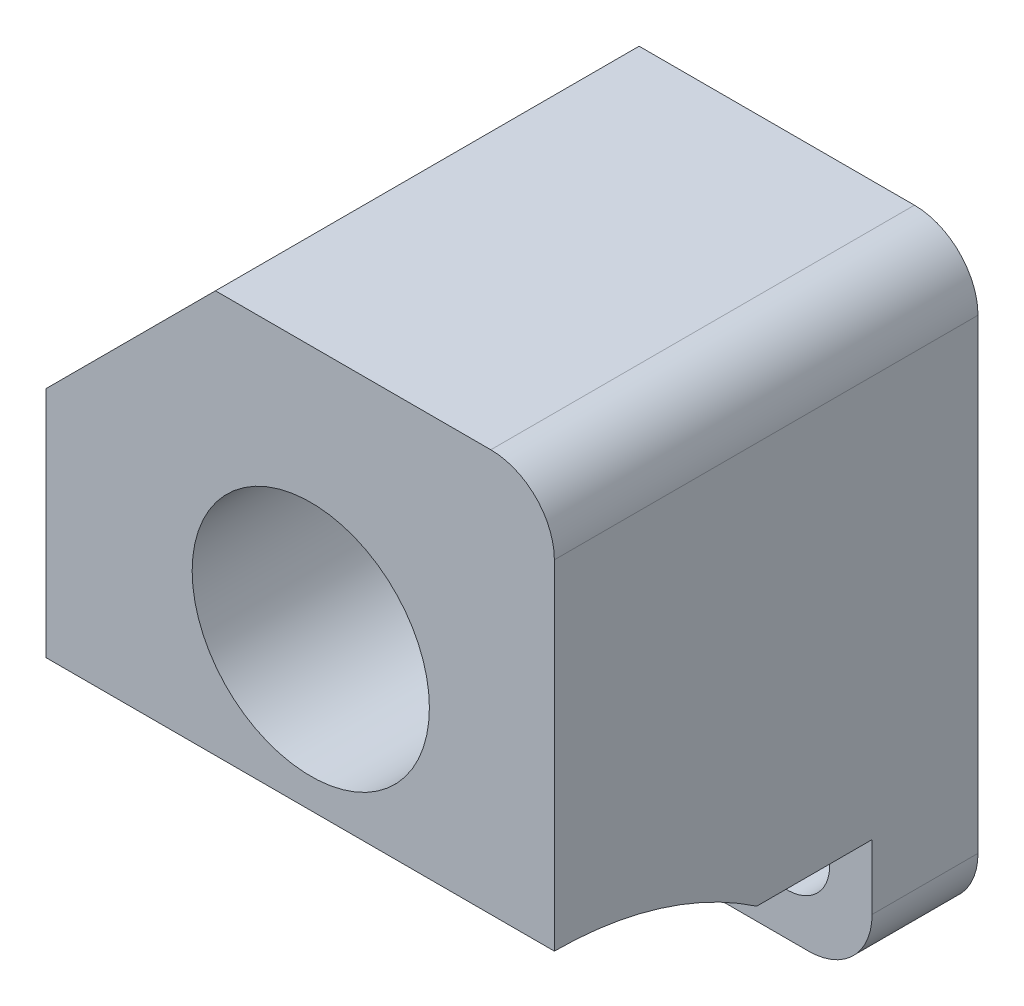
ISO-10303-21;
HEADER;
FILE_DESCRIPTION(('STEP AP214'),'2;1');
FILE_NAME('part.step','',(''),(''),'','','');
FILE_SCHEMA(('AUTOMOTIVE_DESIGN { 1 0 10303 214 1 1 1 1 }'));
ENDSEC;
DATA;
#1=APPLICATION_CONTEXT('core data for automotive mechanical design processes');
#2=APPLICATION_PROTOCOL_DEFINITION('international standard','automotive_design',2000,#1);
#3=PRODUCT_CONTEXT('',#1,'mechanical');
#4=PRODUCT('Part','Part','',(#3));
#5=PRODUCT_RELATED_PRODUCT_CATEGORY('part','',(#4));
#6=PRODUCT_DEFINITION_FORMATION('','',#4);
#7=PRODUCT_DEFINITION_CONTEXT('part definition',#1,'design');
#8=PRODUCT_DEFINITION('design','',#6,#7);
#9=PRODUCT_DEFINITION_SHAPE('','',#8);
#10=(LENGTH_UNIT() NAMED_UNIT(*) SI_UNIT(.MILLI.,.METRE.));
#11=(NAMED_UNIT(*) PLANE_ANGLE_UNIT() SI_UNIT($,.RADIAN.));
#12=(NAMED_UNIT(*) SI_UNIT($,.STERADIAN.) SOLID_ANGLE_UNIT());
#13=UNCERTAINTY_MEASURE_WITH_UNIT(LENGTH_MEASURE(1.E-05),#10,'distance_accuracy_value','');
#14=(GEOMETRIC_REPRESENTATION_CONTEXT(3) GLOBAL_UNCERTAINTY_ASSIGNED_CONTEXT((#13)) GLOBAL_UNIT_ASSIGNED_CONTEXT((#10,
#11,#12)) REPRESENTATION_CONTEXT('',''));
#15=CARTESIAN_POINT('',(0.,0.,0.));
#16=DIRECTION('',(0.,0.,1.));
#17=DIRECTION('',(1.,0.,0.));
#18=AXIS2_PLACEMENT_3D('',#15,#16,#17);
#19=CARTESIAN_POINT('',(-14.,4.,20.));
#20=DIRECTION('',(0.,0.,-1.));
#21=DIRECTION('',(1.,0.,0.));
#22=AXIS2_PLACEMENT_3D('',#19,#20,#21);
#23=CYLINDRICAL_SURFACE('',#22,2.00000000000001);
#24=CARTESIAN_POINT('',(-14.,4.,0.));
#25=DIRECTION('',(0.,0.,-1.));
#26=DIRECTION('',(-1.,0.,0.));
#27=AXIS2_PLACEMENT_3D('',#24,#25,#26);
#28=CIRCLE('',#27,2.00000000000001);
#29=CARTESIAN_POINT('',(-16.,4.,0.));
#30=VERTEX_POINT('',#29);
#31=EDGE_CURVE('E232',#30,#30,#28,.T.);
#32=ORIENTED_EDGE('',*,*,#31,.T.);
#33=EDGE_LOOP('',(#32));
#34=FACE_BOUND('',#33,.T.);
#35=CARTESIAN_POINT('',(-14.,4.,5.));
#36=DIRECTION('',(0.,0.,-1.));
#37=DIRECTION('',(-1.,0.,0.));
#38=AXIS2_PLACEMENT_3D('',#35,#36,#37);
#39=CIRCLE('',#38,2.00000000000001);
#40=CARTESIAN_POINT('',(-16.,4.,5.));
#41=VERTEX_POINT('',#40);
#42=EDGE_CURVE('E175',#41,#41,#39,.T.);
#43=ORIENTED_EDGE('',*,*,#42,.F.);
#44=EDGE_LOOP('',(#43));
#45=FACE_BOUND('',#44,.T.);
#46=ADVANCED_FACE('F52',(#34,#45),#23,.F.);
#47=CARTESIAN_POINT('',(-4.,4.,20.));
#48=DIRECTION('',(0.,0.,-1.));
#49=DIRECTION('',(1.,0.,0.));
#50=AXIS2_PLACEMENT_3D('',#47,#48,#49);
#51=CYLINDRICAL_SURFACE('',#50,2.);
#52=CARTESIAN_POINT('',(-4.,4.,0.));
#53=DIRECTION('',(0.,0.,-1.));
#54=DIRECTION('',(-1.,0.,0.));
#55=AXIS2_PLACEMENT_3D('',#52,#53,#54);
#56=CIRCLE('',#55,2.);
#57=CARTESIAN_POINT('',(-6.,4.,0.));
#58=VERTEX_POINT('',#57);
#59=EDGE_CURVE('E229',#58,#58,#56,.T.);
#60=ORIENTED_EDGE('',*,*,#59,.T.);
#61=EDGE_LOOP('',(#60));
#62=FACE_BOUND('',#61,.T.);
#63=CARTESIAN_POINT('',(-4.,4.,5.));
#64=DIRECTION('',(0.,0.,-1.));
#65=DIRECTION('',(-1.,0.,0.));
#66=AXIS2_PLACEMENT_3D('',#63,#64,#65);
#67=CIRCLE('',#66,2.);
#68=CARTESIAN_POINT('',(-6.,4.,5.));
#69=VERTEX_POINT('',#68);
#70=EDGE_CURVE('E195',#69,#69,#67,.T.);
#71=ORIENTED_EDGE('',*,*,#70,.F.);
#72=EDGE_LOOP('',(#71));
#73=FACE_BOUND('',#72,.T.);
#74=ADVANCED_FACE('F279',(#62,#73),#51,.F.);
#75=CARTESIAN_POINT('',(-30.,-8.,20.));
#76=DIRECTION('',(1.,0.,0.));
#77=DIRECTION('',(0.,0.,1.));
#78=AXIS2_PLACEMENT_3D('',#75,#76,#77);
#79=CYLINDRICAL_SURFACE('',#78,17.);
#80=DIRECTION('',(1.,0.,0.));
#81=VECTOR('',#80,1.);
#82=CARTESIAN_POINT('',(-30.,0.,5.));
#83=LINE('',#82,#81);
#84=CARTESIAN_POINT('',(-21.,0.,5.));
#85=VERTEX_POINT('',#84);
#86=CARTESIAN_POINT('',(-18.5,0.,5.));
#87=VERTEX_POINT('',#86);
#88=EDGE_CURVE('E204',#85,#87,#83,.T.);
#89=ORIENTED_EDGE('',*,*,#88,.T.);
#90=CARTESIAN_POINT('',(-18.5,-8.,20.));
#91=DIRECTION('',(-1.,0.,0.));
#92=DIRECTION('',(0.,0.,1.));
#93=AXIS2_PLACEMENT_3D('',#90,#91,#92);
#94=CIRCLE('',#93,17.);
#95=CARTESIAN_POINT('',(-18.5,4.,7.95840542120771));
#96=VERTEX_POINT('',#95);
#97=EDGE_CURVE('E267',#87,#96,#94,.F.);
#98=ORIENTED_EDGE('',*,*,#97,.T.);
#99=CARTESIAN_POINT('',(-9.5,4.,7.95840542120771));
#100=CARTESIAN_POINT('',(-9.50000395748743,4.0914044943781,8.04949132167229));
#101=CARTESIAN_POINT('',(-9.50278443637128,4.18174793081795,8.14160020463122));
#102=CARTESIAN_POINT('',(-9.51354425939322,4.36014679583887,8.32766663141079));
#103=CARTESIAN_POINT('',(-9.52152221693664,4.44820282814512,8.42162367569323));
#104=CARTESIAN_POINT('',(-9.55268635889075,4.70845168618201,8.70570470111247));
#105=CARTESIAN_POINT('',(-9.58310539350724,4.87705426348768,8.89836667047146));
#106=CARTESIAN_POINT('',(-9.66071062561587,5.20362882044656,9.28883961018568));
#107=CARTESIAN_POINT('',(-9.70788229851281,5.36160986833163,9.48664598307452));
#108=CARTESIAN_POINT('',(-9.81694196826845,5.66682146216995,9.88657773351949));
#109=CARTESIAN_POINT('',(-9.87883788591081,5.81404616592655,10.0887053822212));
#110=CARTESIAN_POINT('',(-10.0422768703318,6.15274010826598,10.5756229392214));
#111=CARTESIAN_POINT('',(-10.1498718371989,6.33910365027113,10.8619413022325));
#112=CARTESIAN_POINT('',(-10.3868255480558,6.69071882436846,11.4386404274752));
#113=CARTESIAN_POINT('',(-10.5161944052909,6.85596058305805,11.7290230196787));
#114=CARTESIAN_POINT('',(-10.725125031537,7.08804017742802,12.1655752813407));
#115=CARTESIAN_POINT('',(-10.7972255833663,7.16275058924888,12.3112143369148));
#116=CARTESIAN_POINT('',(-10.94637421519,7.3069832939709,12.6025231342558));
#117=CARTESIAN_POINT('',(-11.0234218620924,7.37650603987564,12.7481928722268));
#118=CARTESIAN_POINT('',(-11.1825032854109,7.5103435015509,13.039047880639));
#119=CARTESIAN_POINT('',(-11.264533570196,7.57466179233645,13.1842334168163));
#120=CARTESIAN_POINT('',(-11.433928743452,7.69814359271443,13.4736661730226));
#121=CARTESIAN_POINT('',(-11.5212930727269,7.7573076410805,13.6179134896618));
#122=CARTESIAN_POINT('',(-11.7146448878973,7.87839404118929,13.9248458401706));
#123=CARTESIAN_POINT('',(-11.8215253265758,7.93953834902523,14.0872776026382));
#124=CARTESIAN_POINT('',(-12.0448316631065,8.05502203209583,14.408457717902));
#125=CARTESIAN_POINT('',(-12.1612717073346,8.10935101032875,14.5672001490545));
#126=CARTESIAN_POINT('',(-12.345885514194,8.18549337429666,14.800326803985));
#127=CARTESIAN_POINT('',(-12.4093714767174,8.21007449329534,14.8775193491295));
#128=CARTESIAN_POINT('',(-12.5402232570303,8.2572171469658,15.0291673409341));
#129=CARTESIAN_POINT('',(-12.6075876949894,8.27977939267672,15.1036237457641));
#130=CARTESIAN_POINT('',(-12.7469223379722,8.32262625082576,15.2484155210567));
#131=CARTESIAN_POINT('',(-12.8188792369324,8.34291701268087,15.3187617587281));
#132=CARTESIAN_POINT('',(-12.9687167322031,8.38091634160638,15.4535228865071));
#133=CARTESIAN_POINT('',(-13.0465885507,8.39862862548794,15.5179462638691));
#134=CARTESIAN_POINT('',(-13.1941016051383,8.42775727176136,15.6260655479983));
#135=CARTESIAN_POINT('',(-13.2624395430502,8.43972919881483,15.6713638199573));
#136=CARTESIAN_POINT('',(-13.4046729696058,8.46102419614452,15.7530647084529));
#137=CARTESIAN_POINT('',(-13.4785596671599,8.47035134913693,15.7894810237043));
#138=CARTESIAN_POINT('',(-13.6166773372808,8.48406878122557,15.8435466627931));
#139=CARTESIAN_POINT('',(-13.6799311524168,8.48907041147643,15.863482478682));
#140=CARTESIAN_POINT('',(-13.8089781146089,8.49640599885808,15.8928322984602));
#141=CARTESIAN_POINT('',(-13.8747671995161,8.49874405386169,15.9022624646475));
#142=CARTESIAN_POINT('',(-14.0073549707445,8.50048396050065,15.9092730577385));
#143=CARTESIAN_POINT('',(-14.0741569643444,8.49987184283835,15.906797108382));
#144=CARTESIAN_POINT('',(-14.2062203958256,8.49575979538804,15.890258738635));
#145=CARTESIAN_POINT('',(-14.2714801066021,8.49225677252071,15.8761839082241));
#146=CARTESIAN_POINT('',(-14.4177913135748,8.48133054083102,15.8327023930196));
#147=CARTESIAN_POINT('',(-14.497769253972,8.47305145750561,15.7999814858164));
#148=CARTESIAN_POINT('',(-14.6515795378446,8.45325783552328,15.7230994785655));
#149=CARTESIAN_POINT('',(-14.7253934228522,8.44173400121762,15.6789055390671));
#150=CARTESIAN_POINT('',(-14.8821498999958,8.41354873566514,15.5729232290321));
#151=CARTESIAN_POINT('',(-14.9637829499255,8.39631702119702,15.5093877860398));
#152=CARTESIAN_POINT('',(-15.1204837149191,8.35901463834684,15.3753366849474));
#153=CARTESIAN_POINT('',(-15.1955388928886,8.33893873169459,15.3048082210926));
#154=CARTESIAN_POINT('',(-15.3407744029065,8.29628650985611,15.158836412858));
#155=CARTESIAN_POINT('',(-15.4109248104231,8.27369671391476,15.083367561136));
#156=CARTESIAN_POINT('',(-15.5468840112846,8.22638369848768,14.9294019320264));
#157=CARTESIAN_POINT('',(-15.6126961030444,8.20166213357681,14.8509075286325));
#158=CARTESIAN_POINT('',(-15.7716092214206,8.13785763107547,14.6535190431871));
#159=CARTESIAN_POINT('',(-15.8626265891695,8.09758210946055,14.5333369700502));
#160=CARTESIAN_POINT('',(-16.0386639222831,8.01290075716924,14.2900405482304));
#161=CARTESIAN_POINT('',(-16.1236814332532,7.96849325322531,14.166925026778));
#162=CARTESIAN_POINT('',(-16.2888027146167,7.87561177279548,13.9186729687858));
#163=CARTESIAN_POINT('',(-16.3688992404388,7.8271320384045,13.7935337797022));
#164=CARTESIAN_POINT('',(-16.5246639843038,7.72621417175508,13.5420932413085));
#165=CARTESIAN_POINT('',(-16.6003316167907,7.67377551816627,13.4157917408692));
#166=CARTESIAN_POINT('',(-16.8214258279169,7.51044543156766,13.0356530003998));
#167=CARTESIAN_POINT('',(-16.960800768262,7.39362125441372,12.7808007169415));
#168=CARTESIAN_POINT('',(-17.2243785507563,7.14423442726891,12.2713107945576));
#169=CARTESIAN_POINT('',(-17.3485935073991,7.01168451315524,12.0166731478797));
#170=CARTESIAN_POINT('',(-17.5876510079521,6.72317416813715,11.4958040227481));
#171=CARTESIAN_POINT('',(-17.7016599519492,6.56635037299425,11.2296651599127));
#172=CARTESIAN_POINT('',(-17.9108486053268,6.2346613390059,10.7009761246614));
#173=CARTESIAN_POINT('',(-18.0060184144837,6.05978668723912,10.4384279062847));
#174=CARTESIAN_POINT('',(-18.1741829876603,5.69311968600992,9.9203860058721));
#175=CARTESIAN_POINT('',(-18.2472997352338,5.50142826457879,9.66486089874401));
#176=CARTESIAN_POINT('',(-18.3682677475141,5.10087784416679,9.16163419247375));
#177=CARTESIAN_POINT('',(-18.4161475882968,4.89203857308064,8.91392404457169));
#178=CARTESIAN_POINT('',(-18.4655378014299,4.56660518108971,8.54980075912049));
#179=CARTESIAN_POINT('',(-18.4782647178343,4.45595648186604,8.42952511075732));
#180=CARTESIAN_POINT('',(-18.4954961993189,4.23078580948268,8.19175047629548));
#181=CARTESIAN_POINT('',(-18.49998969487,4.11625883237395,8.07425543767465));
#182=CARTESIAN_POINT('',(-18.5,4.00000000000001,7.95840542120771));
#183=B_SPLINE_CURVE_WITH_KNOTS('',3,(#99,#100,#101,#102,#103,#104,#105,#106,#107,#108,#109,#110,
#111,#112,#113,#114,#115,#116,#117,#118,#119,#120,#121,#122,#123,#124,#125,#126,#127,#128,#129,
#130,#131,#132,#133,#134,#135,#136,#137,#138,#139,#140,#141,#142,#143,#144,#145,#146,#147,#148,
#149,#150,#151,#152,#153,#154,#155,#156,#157,#158,#159,#160,#161,#162,#163,#164,#165,#166,#167,
#168,#169,#170,#171,#172,#173,#174,#175,#176,#177,#178,#179,#180,#181,#182),.UNSPECIFIED.,.F.,
.F.,(4,2,2,2,2,2,2,2,2,2,2,2,2,2,2,2,2,2,2,2,2,2,2,2,2,2,2,2,2,2,2,2,2,2,2,2,2,2,2,2,2,4),(0.,
0.387032748470064,0.773962285759765,1.54643256241779,2.31823473316158,3.09045303102278,
4.16348813096331,5.23702300224475,5.77348634923154,6.30990279556861,6.84594758523306,
7.38193627466361,7.99314134345302,8.60526776995012,8.91394559425845,9.22251427200547,
9.53022628057543,9.83749024208736,10.0855769742731,10.3332786257619,10.5320323216932,
10.7304798231721,10.929867909676,11.1294696053839,11.3884157008732,11.6481113147416,
11.9620016742115,12.2764778415883,12.5927300136787,12.9087388983729,13.3766012997366,
13.8446539958794,14.3133800067392,14.7821678498207,15.7205636951521,16.658204679695,
17.6450375397983,18.6323876253434,19.6141716947542,20.5948416761479,21.0863721296846,
21.5785629441533),.UNSPECIFIED.);
#184=CARTESIAN_POINT('',(-9.5,4.,7.95840542120771));
#185=VERTEX_POINT('',#184);
#186=EDGE_CURVE('E258',#185,#96,#183,.T.);
#187=ORIENTED_EDGE('',*,*,#186,.F.);
#188=CARTESIAN_POINT('',(-9.50000000000001,-8.,20.));
#189=DIRECTION('',(-1.,0.,0.));
#190=DIRECTION('',(0.,-1.,0.));
#191=AXIS2_PLACEMENT_3D('',#188,#189,#190);
#192=CIRCLE('',#191,17.);
#193=CARTESIAN_POINT('',(-9.5,0.,5.));
#194=VERTEX_POINT('',#193);
#195=EDGE_CURVE('E255',#194,#185,#192,.F.);
#196=ORIENTED_EDGE('',*,*,#195,.F.);
#197=CARTESIAN_POINT('',(-8.49999999999999,0.,5.));
#198=VERTEX_POINT('',#197);
#199=EDGE_CURVE('E389',#194,#198,#83,.T.);
#200=ORIENTED_EDGE('',*,*,#199,.T.);
#201=CARTESIAN_POINT('',(-8.49999999999999,-8.,20.));
#202=DIRECTION('',(-1.,0.,0.));
#203=DIRECTION('',(0.,0.,1.));
#204=AXIS2_PLACEMENT_3D('',#201,#202,#203);
#205=CIRCLE('',#204,17.);
#206=CARTESIAN_POINT('',(-8.49999999999999,4.,7.95840542120771));
#207=VERTEX_POINT('',#206);
#208=EDGE_CURVE('E178',#198,#207,#205,.F.);
#209=ORIENTED_EDGE('',*,*,#208,.T.);
#210=CARTESIAN_POINT('',(0.,6.06155281280885,10.4463236137816));
#211=CARTESIAN_POINT('',(-0.0495576649739206,6.15768125691109,10.5878060626458));
#212=CARTESIAN_POINT('',(-0.102114391334273,6.25117350422128,10.7300098451449));
#213=CARTESIAN_POINT('',(-0.212865824775228,6.43289213636139,11.0155556706595));
#214=CARTESIAN_POINT('',(-0.271059795672405,6.52111920636005,11.1588975628075));
#215=CARTESIAN_POINT('',(-0.392808866787494,6.69243783253494,11.4466181049227));
#216=CARTESIAN_POINT('',(-0.45637007379429,6.77552334734409,11.5909977600859));
#217=CARTESIAN_POINT('',(-0.588562309680955,6.93648457041131,11.8803427208734));
#218=CARTESIAN_POINT('',(-0.657193475464848,7.01436013787696,12.0253080422125));
#219=CARTESIAN_POINT('',(-0.798884011374749,7.16440014843562,12.3144739217149));
#220=CARTESIAN_POINT('',(-0.871908451567413,7.23660124035958,12.4586725948106));
#221=CARTESIAN_POINT('',(-1.02281525786022,7.37593242064748,12.7469777116518));
#222=CARTESIAN_POINT('',(-1.10069759281922,7.44306254151237,12.8910841559824));
#223=CARTESIAN_POINT('',(-1.26141572676633,7.57222318194456,13.1786591519161));
#224=CARTESIAN_POINT('',(-1.34424781751823,7.6342574384805,13.3221280966491));
#225=CARTESIAN_POINT('',(-1.5152789966516,7.7532682254799,13.6079356867605));
#226=CARTESIAN_POINT('',(-1.60347707727965,7.81024570071446,13.7502745387328));
#227=CARTESIAN_POINT('',(-1.74501163673931,7.89466979089833,13.9695401930718));
#228=CARTESIAN_POINT('',(-1.79622918526569,7.92389345240162,14.0471540620925));
#229=CARTESIAN_POINT('',(-1.90070785779715,7.98076651506496,14.2015620776224));
#230=CARTESIAN_POINT('',(-1.95396882616314,8.00841603572414,14.2783562859946));
#231=CARTESIAN_POINT('',(-2.11754724864029,8.08916521438071,14.5077323909514));
#232=CARTESIAN_POINT('',(-2.23131987915113,8.13986032677673,14.6587727944357));
#233=CARTESIAN_POINT('',(-2.41172254496275,8.21088686373001,14.8801113434367));
#234=CARTESIAN_POINT('',(-2.47376765201981,8.23381360743637,14.9533226614076));
#235=CARTESIAN_POINT('',(-2.60166171762401,8.27776007998216,15.0969247590182));
#236=CARTESIAN_POINT('',(-2.66750920702344,8.29878053740091,15.1673166104608));
#237=CARTESIAN_POINT('',(-2.80364504189143,8.33863453962015,15.3038252643999));
#238=CARTESIAN_POINT('',(-2.87391594679102,8.35747593270061,15.3699570030888));
#239=CARTESIAN_POINT('',(-3.02019428658114,8.39267996794466,15.4961890159489));
#240=CARTESIAN_POINT('',(-3.09619277785561,8.40904635939768,15.5562983656353));
#241=CARTESIAN_POINT('',(-3.23997433299755,8.43583388612464,15.6565541951015));
#242=CARTESIAN_POINT('',(-3.30651305772318,8.44679284085669,15.698314641397));
#243=CARTESIAN_POINT('',(-3.44475719099679,8.46615695450915,15.7730432755605));
#244=CARTESIAN_POINT('',(-3.51645534062082,8.47456561782761,15.8060235207584));
#245=CARTESIAN_POINT('',(-3.65181174771634,8.48692936737446,15.8549197405297));
#246=CARTESIAN_POINT('',(-3.71469219259568,8.49140533721395,15.8728083702534));
#247=CARTESIAN_POINT('',(-3.84265512732479,8.49770244108512,15.8980502427217));
#248=CARTESIAN_POINT('',(-3.90773439582635,8.49952730004356,15.905418267127));
#249=CARTESIAN_POINT('',(-4.03841703934404,8.50031160723747,15.9085795275067));
#250=CARTESIAN_POINT('',(-4.10402143159,8.49926168677995,15.9043349188076));
#251=CARTESIAN_POINT('',(-4.23346686626613,8.49440840313794,15.8848347955379));
#252=CARTESIAN_POINT('',(-4.29730579896246,8.49060188189705,15.8695666520884));
#253=CARTESIAN_POINT('',(-4.44415637976978,8.47883173633285,15.8228168546013));
#254=CARTESIAN_POINT('',(-4.52583462857109,8.46986690084409,15.7874845386656));
#255=CARTESIAN_POINT('',(-4.68268853197767,8.44862355653986,15.7052840649633));
#256=CARTESIAN_POINT('',(-4.75784343504033,8.43633495050804,15.6583807948354));
#257=CARTESIAN_POINT('',(-4.92025432248834,8.40585509013416,15.5444197850747));
#258=CARTESIAN_POINT('',(-5.0058655252465,8.38695596746616,15.4752514137612));
#259=CARTESIAN_POINT('',(-5.16998832694384,8.34606527389865,15.3296781380078));
#260=CARTESIAN_POINT('',(-5.24848572092243,8.32406773029688,15.2532593523577));
#261=CARTESIAN_POINT('',(-5.40027014659419,8.27733288019952,15.0953843437004));
#262=CARTESIAN_POINT('',(-5.47352516407381,8.25258076773555,15.0139020508639));
#263=CARTESIAN_POINT('',(-5.61543120195653,8.20072323831264,14.8478999287723));
#264=CARTESIAN_POINT('',(-5.68408588263559,8.17361973261968,14.7633825986168));
#265=CARTESIAN_POINT('',(-5.84754402249093,8.10458362418915,14.5539587498927));
#266=CARTESIAN_POINT('',(-5.94032556091213,8.06143596543084,14.4278782021141));
#267=CARTESIAN_POINT('',(-6.11977951003649,7.97072107976093,14.172958887522));
#268=CARTESIAN_POINT('',(-6.20644962484322,7.92315220731197,14.0441191075873));
#269=CARTESIAN_POINT('',(-6.37472617121714,7.82364250659821,13.7845611026642));
#270=CARTESIAN_POINT('',(-6.45632549938857,7.77169577525271,13.6538405450246));
#271=CARTESIAN_POINT('',(-6.61491101985108,7.66352850990836,13.3913659733939));
#272=CARTESIAN_POINT('',(-6.69189662139773,7.6073074307012,13.259611829494));
#273=CARTESIAN_POINT('',(-6.91659819698224,7.43214530932722,12.863313707642));
#274=CARTESIAN_POINT('',(-7.05793006491751,7.30678238992181,12.5979364494451));
#275=CARTESIAN_POINT('',(-7.32419305110221,7.03896458345784,12.0679303655702));
#276=CARTESIAN_POINT('',(-7.44913671657052,6.89652293414528,11.8033011208903));
#277=CARTESIAN_POINT('',(-7.68648538147722,6.58827003178546,11.2660425052635));
#278=CARTESIAN_POINT('',(-7.79820351766676,6.42175974405671,10.9935080878885));
#279=CARTESIAN_POINT('',(-8.000981321762,6.0696449211596,10.4527898492503));
#280=CARTESIAN_POINT('',(-8.09202889259739,5.88402929681057,10.1846086604322));
#281=CARTESIAN_POINT('',(-8.24951498175138,5.4951195968456,9.65646752054583));
#282=CARTESIAN_POINT('',(-8.31609956757428,5.29193970674486,9.39646753812656));
#283=CARTESIAN_POINT('',(-8.42091289852289,4.8678318980931,8.88565157098579));
#284=CARTESIAN_POINT('',(-8.45918198729399,4.64692972977264,8.63482300551478));
#285=CARTESIAN_POINT('',(-8.48690506487228,4.34983282300977,8.3170346335463));
#286=CARTESIAN_POINT('',(-8.4917708003499,4.28082350732532,8.24451527492893));
#287=CARTESIAN_POINT('',(-8.49831860405032,4.14142347535715,8.10059406157309));
#288=CARTESIAN_POINT('',(-8.49999891691505,4.0710320190039,8.02919284447611));
#289=CARTESIAN_POINT('',(-8.49999999999999,4.00000000000001,7.95840542120771));
#290=B_SPLINE_CURVE_WITH_KNOTS('',3,(#210,#211,#212,#213,#214,#215,#216,#217,#218,#219,#220,
#221,#222,#223,#224,#225,#226,#227,#228,#229,#230,#231,#232,#233,#234,#235,#236,#237,#238,#239,
#240,#241,#242,#243,#244,#245,#246,#247,#248,#249,#250,#251,#252,#253,#254,#255,#256,#257,#258,
#259,#260,#261,#262,#263,#264,#265,#266,#267,#268,#269,#270,#271,#272,#273,#274,#275,#276,#277,
#278,#279,#280,#281,#282,#283,#284,#285,#286,#287,#288,#289),.UNSPECIFIED.,.F.,.F.,(4,2,2,2,2,2,
2,2,2,2,2,2,2,2,2,2,2,2,2,2,2,2,2,2,2,2,2,2,2,2,2,2,2,2,2,2,2,2,2,4),(0.,0.534183463738145,
1.06829726077904,1.60302717411927,2.13777153204551,2.66871623739945,3.19965753952524,
3.73020594252472,4.26065501224732,4.55304054148975,4.84540384493812,5.43212733620589,
5.72803457156631,6.02382823080679,6.31852097611865,6.61276273121027,6.85022908133134,
7.0873676309592,7.28315977433267,7.478676554229,7.67483126652403,7.87121105660811,
8.13800846182934,8.40562565000821,8.73986125195806,9.07475019580597,9.41153509711945,
9.74804877176998,10.2349133587101,10.7219598836621,11.2096739819451,11.6974503946079,
12.6737573381519,13.649312378311,14.6632555597851,15.6777906120536,16.6861654857414,
17.6931008553943,17.9937245118364,18.2945137817645),.UNSPECIFIED.);
#291=CARTESIAN_POINT('',(0.,6.06155281280885,10.4463236137816));
#292=VERTEX_POINT('',#291);
#293=EDGE_CURVE('E171',#292,#207,#290,.T.);
#294=ORIENTED_EDGE('',*,*,#293,.F.);
#295=CARTESIAN_POINT('',(0.,-8.,20.));
#296=DIRECTION('',(-1.,0.,0.));
#297=DIRECTION('',(0.,0.,1.));
#298=AXIS2_PLACEMENT_3D('',#295,#296,#297);
#299=CIRCLE('',#298,17.);
#300=CARTESIAN_POINT('',(0.,9.,20.));
#301=VERTEX_POINT('',#300);
#302=EDGE_CURVE('E200',#301,#292,#299,.T.);
#303=ORIENTED_EDGE('',*,*,#302,.F.);
#304=DIRECTION('',(1.,0.,0.));
#305=VECTOR('',#304,1.);
#306=CARTESIAN_POINT('',(-30.,9.,20.));
#307=LINE('',#306,#305);
#308=CARTESIAN_POINT('',(-24.,9.,20.));
#309=VERTEX_POINT('',#308);
#310=EDGE_CURVE('E252',#309,#301,#307,.T.);
#311=ORIENTED_EDGE('',*,*,#310,.F.);
#312=CARTESIAN_POINT('',(-24.,-8.,20.));
#313=DIRECTION('',(-1.,0.,0.));
#314=DIRECTION('',(0.,0.,1.));
#315=AXIS2_PLACEMENT_3D('',#312,#313,#314);
#316=CIRCLE('',#315,17.);
#317=CARTESIAN_POINT('',(-24.,3.,7.03851860318428));
#318=VERTEX_POINT('',#317);
#319=EDGE_CURVE('E207',#309,#318,#316,.T.);
#320=ORIENTED_EDGE('',*,*,#319,.T.);
#321=CARTESIAN_POINT('',(-21.,0.,5.));
#322=CARTESIAN_POINT('',(-21.0764088854411,-1.20717350892555E-05,4.99999811573288));
#323=CARTESIAN_POINT('',(-21.1528122415604,0.00291890408008091,5.00155686392892));
#324=CARTESIAN_POINT('',(-21.305033199817,0.0145751360655718,5.00777984418738));
#325=CARTESIAN_POINT('',(-21.380850918302,0.0232992097306947,5.01244344247861));
#326=CARTESIAN_POINT('',(-21.5311310912768,0.0464150590027096,5.02484167087533));
#327=CARTESIAN_POINT('',(-21.605596937509,0.0607897001509363,5.03256701728735));
#328=CARTESIAN_POINT('',(-21.752854744433,0.0950158277154609,5.05105038471105));
#329=CARTESIAN_POINT('',(-21.8256466791367,0.114867399100566,5.06180845277228));
#330=CARTESIAN_POINT('',(-22.040710341514,0.182301746184372,5.09857082495992));
#331=CARTESIAN_POINT('',(-22.1798457162863,0.237791763147097,5.12907775409014));
#332=CARTESIAN_POINT('',(-22.4459038982596,0.367262546665944,5.2015412051815));
#333=CARTESIAN_POINT('',(-22.5728222857226,0.441249970465268,5.24350184985156));
#334=CARTESIAN_POINT('',(-22.815731712799,0.607212634009006,5.33966742130828));
#335=CARTESIAN_POINT('',(-22.9312401293523,0.699689792304387,5.39422269187068));
#336=CARTESIAN_POINT('',(-23.144683707385,0.897260708028354,5.51372799762142));
#337=CARTESIAN_POINT('',(-23.2426135343048,1.00235827926834,5.57868117697929));
#338=CARTESIAN_POINT('',(-23.429258464551,1.23282793684815,5.72500975226815));
#339=CARTESIAN_POINT('',(-23.5159793076029,1.35917302313789,5.80738818726223));
#340=CARTESIAN_POINT('',(-23.6671475183482,1.61837824079589,5.98175312170164));
#341=CARTESIAN_POINT('',(-23.731578597622,1.75124305589147,6.07374658375145));
#342=CARTESIAN_POINT('',(-23.8475988611937,2.04119929945403,6.28100233865607));
#343=CARTESIAN_POINT('',(-23.8955026691378,2.19877587214032,6.39763604585119));
#344=CARTESIAN_POINT('',(-23.9646098985642,2.51317106338381,6.63914355718186));
#345=CARTESIAN_POINT('',(-23.9858288038118,2.66999006884038,6.76401253853305));
#346=CARTESIAN_POINT('',(-23.9983146689567,2.88355082731465,6.94035898978488));
#347=CARTESIAN_POINT('',(-23.9999991241123,2.94195900161804,6.98925305938526));
#348=CARTESIAN_POINT('',(-24.,3.,7.03851860318428));
#349=B_SPLINE_CURVE_WITH_KNOTS('',3,(#321,#322,#323,#324,#325,#326,#327,#328,#329,#330,#331,
#332,#333,#334,#335,#336,#337,#338,#339,#340,#341,#342,#343,#344,#345,#346,#347,#348),
.UNSPECIFIED.,.F.,.F.,(4,2,2,2,2,2,2,2,2,2,2,2,2,4),(0.,0.229145118120811,0.458243476797829,
0.686652424242741,0.915064915411317,1.37136112884847,1.82782180095093,2.29896062787174,
2.77024219005592,3.29016520838336,3.81046736592894,4.41372579560865,5.01663402621998,
5.24509986542481),.UNSPECIFIED.);
#350=EDGE_CURVE('E60',#85,#318,#349,.T.);
#351=ORIENTED_EDGE('',*,*,#350,.F.);
#352=EDGE_LOOP('',(#89,#98,#187,#196,#200,#209,#294,#303,#311,#320,#351));
#353=FACE_BOUND('',#352,.T.);
#354=ADVANCED_FACE('F273',(#353),#79,.F.);
#355=CARTESIAN_POINT('',(0.,0.,20.));
#356=DIRECTION('',(0.,1.,0.));
#357=DIRECTION('',(0.,0.,1.));
#358=AXIS2_PLACEMENT_3D('',#355,#356,#357);
#359=PLANE('',#358);
#360=DIRECTION('',(-1.,0.,0.));
#361=VECTOR('',#360,1.);
#362=CARTESIAN_POINT('',(0.,0.,0.));
#363=LINE('',#362,#361);
#364=CARTESIAN_POINT('',(-3.,0.,0.));
#365=VERTEX_POINT('',#364);
#366=CARTESIAN_POINT('',(-21.,0.,0.));
#367=VERTEX_POINT('',#366);
#368=EDGE_CURVE('E235',#365,#367,#363,.T.);
#369=ORIENTED_EDGE('',*,*,#368,.F.);
#370=DIRECTION('',(0.,0.,-1.));
#371=VECTOR('',#370,1.);
#372=CARTESIAN_POINT('',(-3.,0.,0.));
#373=LINE('',#372,#371);
#374=CARTESIAN_POINT('',(-3.,0.,5.));
#375=VERTEX_POINT('',#374);
#376=EDGE_CURVE('E372',#375,#365,#373,.T.);
#377=ORIENTED_EDGE('',*,*,#376,.F.);
#378=EDGE_CURVE('E203',#198,#375,#83,.T.);
#379=ORIENTED_EDGE('',*,*,#378,.F.);
#380=ORIENTED_EDGE('',*,*,#199,.F.);
#381=EDGE_CURVE('E208',#87,#194,#83,.T.);
#382=ORIENTED_EDGE('',*,*,#381,.F.);
#383=ORIENTED_EDGE('',*,*,#88,.F.);
#384=DIRECTION('',(0.,0.,-1.));
#385=VECTOR('',#384,1.);
#386=CARTESIAN_POINT('',(-21.,0.,20.));
#387=LINE('',#386,#385);
#388=EDGE_CURVE('E73',#367,#85,#387,.F.);
#389=ORIENTED_EDGE('',*,*,#388,.F.);
#390=EDGE_LOOP('',(#369,#377,#379,#380,#382,#383,#389));
#391=FACE_BOUND('',#390,.T.);
#392=ADVANCED_FACE('F278',(#391),#359,.F.);
#393=CARTESIAN_POINT('',(-24.,0.,20.));
#394=DIRECTION('',(1.,0.,0.));
#395=DIRECTION('',(0.,0.,1.));
#396=AXIS2_PLACEMENT_3D('',#393,#394,#395);
#397=PLANE('',#396);
#398=ORIENTED_EDGE('',*,*,#319,.F.);
#399=DIRECTION('',(0.,1.,0.));
#400=VECTOR('',#399,1.);
#401=CARTESIAN_POINT('',(-24.,0.,20.));
#402=LINE('',#401,#400);
#403=CARTESIAN_POINT('',(-24.,20.,20.));
#404=VERTEX_POINT('',#403);
#405=EDGE_CURVE('E215',#309,#404,#402,.T.);
#406=ORIENTED_EDGE('',*,*,#405,.T.);
#407=DIRECTION('',(0.,0.,-1.));
#408=VECTOR('',#407,1.);
#409=CARTESIAN_POINT('',(-24.,20.,20.));
#410=LINE('',#409,#408);
#411=CARTESIAN_POINT('',(-24.,20.,0.));
#412=VERTEX_POINT('',#411);
#413=EDGE_CURVE('E249',#404,#412,#410,.T.);
#414=ORIENTED_EDGE('',*,*,#413,.T.);
#415=DIRECTION('',(0.,1.,0.));
#416=VECTOR('',#415,1.);
#417=CARTESIAN_POINT('',(-24.,0.,0.));
#418=LINE('',#417,#416);
#419=CARTESIAN_POINT('',(-24.,3.,0.));
#420=VERTEX_POINT('',#419);
#421=EDGE_CURVE('E238',#420,#412,#418,.T.);
#422=ORIENTED_EDGE('',*,*,#421,.F.);
#423=DIRECTION('',(0.,0.,-1.));
#424=VECTOR('',#423,1.);
#425=CARTESIAN_POINT('',(-24.,3.,20.));
#426=LINE('',#425,#424);
#427=EDGE_CURVE('E370',#318,#420,#426,.T.);
#428=ORIENTED_EDGE('',*,*,#427,.F.);
#429=EDGE_LOOP('',(#398,#406,#414,#422,#428));
#430=FACE_BOUND('',#429,.T.);
#431=ADVANCED_FACE('F321',(#430),#397,.F.);
#432=CARTESIAN_POINT('',(-22.,22.,20.));
#433=DIRECTION('',(-0.707106781186549,0.707106781186546,0.));
#434=DIRECTION('',(0.707106781186546,0.707106781186549,0.));
#435=AXIS2_PLACEMENT_3D('',#432,#433,#434);
#436=PLANE('',#435);
#437=DIRECTION('',(-0.707106781186546,-0.707106781186549,0.));
#438=VECTOR('',#437,1.);
#439=CARTESIAN_POINT('',(-22.,22.,0.));
#440=LINE('',#439,#438);
#441=CARTESIAN_POINT('',(-16.,28.,0.));
#442=VERTEX_POINT('',#441);
#443=EDGE_CURVE('E241',#442,#412,#440,.T.);
#444=ORIENTED_EDGE('',*,*,#443,.T.);
#445=ORIENTED_EDGE('',*,*,#413,.F.);
#446=DIRECTION('',(-0.707106781186546,-0.707106781186549,0.));
#447=VECTOR('',#446,1.);
#448=CARTESIAN_POINT('',(-22.,22.,20.));
#449=LINE('',#448,#447);
#450=CARTESIAN_POINT('',(-16.,28.,20.));
#451=VERTEX_POINT('',#450);
#452=EDGE_CURVE('E219',#451,#404,#449,.T.);
#453=ORIENTED_EDGE('',*,*,#452,.F.);
#454=DIRECTION('',(0.,0.,-1.));
#455=VECTOR('',#454,1.);
#456=CARTESIAN_POINT('',(-16.,28.,20.));
#457=LINE('',#456,#455);
#458=EDGE_CURVE('E226',#451,#442,#457,.T.);
#459=ORIENTED_EDGE('',*,*,#458,.T.);
#460=EDGE_LOOP('',(#444,#445,#453,#459));
#461=FACE_BOUND('',#460,.T.);
#462=ADVANCED_FACE('F325',(#461),#436,.T.);
#463=CARTESIAN_POINT('',(0.,28.,20.));
#464=DIRECTION('',(0.,1.,0.));
#465=DIRECTION('',(0.,0.,1.));
#466=AXIS2_PLACEMENT_3D('',#463,#464,#465);
#467=PLANE('',#466);
#468=DIRECTION('',(-1.,0.,0.));
#469=VECTOR('',#468,1.);
#470=CARTESIAN_POINT('',(0.,28.,0.));
#471=LINE('',#470,#469);
#472=CARTESIAN_POINT('',(-3.,28.,0.));
#473=VERTEX_POINT('',#472);
#474=EDGE_CURVE('E243',#473,#442,#471,.T.);
#475=ORIENTED_EDGE('',*,*,#474,.T.);
#476=ORIENTED_EDGE('',*,*,#458,.F.);
#477=DIRECTION('',(-1.,0.,0.));
#478=VECTOR('',#477,1.);
#479=CARTESIAN_POINT('',(0.,28.,20.));
#480=LINE('',#479,#478);
#481=CARTESIAN_POINT('',(-3.,28.,20.));
#482=VERTEX_POINT('',#481);
#483=EDGE_CURVE('E221',#482,#451,#480,.T.);
#484=ORIENTED_EDGE('',*,*,#483,.F.);
#485=DIRECTION('',(0.,0.,-1.));
#486=VECTOR('',#485,1.);
#487=CARTESIAN_POINT('',(-3.,28.,20.));
#488=LINE('',#487,#486);
#489=EDGE_CURVE('E365',#473,#482,#488,.F.);
#490=ORIENTED_EDGE('',*,*,#489,.F.);
#491=EDGE_LOOP('',(#475,#476,#484,#490));
#492=FACE_BOUND('',#491,.T.);
#493=ADVANCED_FACE('F311',(#492),#467,.T.);
#494=CARTESIAN_POINT('',(-11.5,16.,20.));
#495=DIRECTION('',(0.,0.,-1.));
#496=DIRECTION('',(1.,0.,0.));
#497=AXIS2_PLACEMENT_3D('',#494,#495,#496);
#498=CYLINDRICAL_SURFACE('',#497,5.6);
#499=CARTESIAN_POINT('',(-11.5,16.,20.));
#500=DIRECTION('',(0.,0.,-1.));
#501=DIRECTION('',(-1.,0.,0.));
#502=AXIS2_PLACEMENT_3D('',#499,#500,#501);
#503=CIRCLE('',#502,5.6);
#504=CARTESIAN_POINT('',(-17.1,16.,20.));
#505=VERTEX_POINT('',#504);
#506=EDGE_CURVE('E212',#505,#505,#503,.T.);
#507=ORIENTED_EDGE('',*,*,#506,.F.);
#508=EDGE_LOOP('',(#507));
#509=FACE_BOUND('',#508,.T.);
#510=CARTESIAN_POINT('',(-11.5,16.,0.));
#511=DIRECTION('',(0.,0.,-1.));
#512=DIRECTION('',(-1.,0.,0.));
#513=AXIS2_PLACEMENT_3D('',#510,#511,#512);
#514=CIRCLE('',#513,5.6);
#515=CARTESIAN_POINT('',(-17.1,16.,0.));
#516=VERTEX_POINT('',#515);
#517=EDGE_CURVE('E211',#516,#516,#514,.T.);
#518=ORIENTED_EDGE('',*,*,#517,.T.);
#519=EDGE_LOOP('',(#518));
#520=FACE_BOUND('',#519,.T.);
#521=ADVANCED_FACE('F307',(#509,#520),#498,.F.);
#522=CARTESIAN_POINT('',(0.,0.,20.));
#523=DIRECTION('',(1.,0.,0.));
#524=DIRECTION('',(0.,0.,1.));
#525=AXIS2_PLACEMENT_3D('',#522,#523,#524);
#526=PLANE('',#525);
#527=DIRECTION('',(0.,1.,0.));
#528=VECTOR('',#527,1.);
#529=CARTESIAN_POINT('',(0.,0.,20.));
#530=LINE('',#529,#528);
#531=CARTESIAN_POINT('',(0.,25.,20.));
#532=VERTEX_POINT('',#531);
#533=EDGE_CURVE('E223',#301,#532,#530,.T.);
#534=ORIENTED_EDGE('',*,*,#533,.F.);
#535=ORIENTED_EDGE('',*,*,#302,.T.);
#536=DIRECTION('',(0.,0.,1.));
#537=VECTOR('',#536,1.);
#538=CARTESIAN_POINT('',(0.,6.06155281280885,5.));
#539=LINE('',#538,#537);
#540=CARTESIAN_POINT('',(0.,6.06155281280885,5.));
#541=VERTEX_POINT('',#540);
#542=EDGE_CURVE('E198',#292,#541,#539,.F.);
#543=ORIENTED_EDGE('',*,*,#542,.T.);
#544=DIRECTION('',(0.,-1.,0.));
#545=VECTOR('',#544,1.);
#546=CARTESIAN_POINT('',(0.,0.,5.));
#547=LINE('',#546,#545);
#548=CARTESIAN_POINT('',(0.,3.,5.));
#549=VERTEX_POINT('',#548);
#550=EDGE_CURVE('E162',#541,#549,#547,.T.);
#551=ORIENTED_EDGE('',*,*,#550,.T.);
#552=DIRECTION('',(0.,0.,-1.));
#553=VECTOR('',#552,1.);
#554=CARTESIAN_POINT('',(0.,3.,5.));
#555=LINE('',#554,#553);
#556=CARTESIAN_POINT('',(0.,3.,0.));
#557=VERTEX_POINT('',#556);
#558=EDGE_CURVE('E357',#557,#549,#555,.F.);
#559=ORIENTED_EDGE('',*,*,#558,.F.);
#560=DIRECTION('',(0.,1.,0.));
#561=VECTOR('',#560,1.);
#562=CARTESIAN_POINT('',(0.,0.,0.));
#563=LINE('',#562,#561);
#564=CARTESIAN_POINT('',(0.,25.,0.));
#565=VERTEX_POINT('',#564);
#566=EDGE_CURVE('E216',#557,#565,#563,.T.);
#567=ORIENTED_EDGE('',*,*,#566,.T.);
#568=DIRECTION('',(0.,0.,-1.));
#569=VECTOR('',#568,1.);
#570=CARTESIAN_POINT('',(0.,25.,20.));
#571=LINE('',#570,#569);
#572=EDGE_CURVE('E358',#532,#565,#571,.T.);
#573=ORIENTED_EDGE('',*,*,#572,.F.);
#574=EDGE_LOOP('',(#534,#535,#543,#551,#559,#567,#573));
#575=FACE_BOUND('',#574,.T.);
#576=ADVANCED_FACE('F310',(#575),#526,.T.);
#577=CARTESIAN_POINT('',(0.,0.,20.));
#578=DIRECTION('',(0.,0.,1.));
#579=DIRECTION('',(-1.,0.,0.));
#580=AXIS2_PLACEMENT_3D('',#577,#578,#579);
#581=PLANE('',#580);
#582=ORIENTED_EDGE('',*,*,#483,.T.);
#583=ORIENTED_EDGE('',*,*,#452,.T.);
#584=ORIENTED_EDGE('',*,*,#405,.F.);
#585=ORIENTED_EDGE('',*,*,#310,.T.);
#586=ORIENTED_EDGE('',*,*,#533,.T.);
#587=CARTESIAN_POINT('',(-3.,25.,20.));
#588=DIRECTION('',(0.,0.,-1.));
#589=DIRECTION('',(-1.,0.,0.));
#590=AXIS2_PLACEMENT_3D('',#587,#588,#589);
#591=CIRCLE('',#590,3.);
#592=EDGE_CURVE('E368',#482,#532,#591,.T.);
#593=ORIENTED_EDGE('',*,*,#592,.F.);
#594=EDGE_LOOP('',(#582,#583,#584,#585,#586,#593));
#595=FACE_BOUND('',#594,.T.);
#596=ORIENTED_EDGE('',*,*,#506,.T.);
#597=EDGE_LOOP('',(#596));
#598=FACE_BOUND('',#597,.T.);
#599=ADVANCED_FACE('F283',(#595,#598),#581,.T.);
#600=CARTESIAN_POINT('',(0.,0.,0.));
#601=DIRECTION('',(0.,0.,1.));
#602=DIRECTION('',(-1.,0.,0.));
#603=AXIS2_PLACEMENT_3D('',#600,#601,#602);
#604=PLANE('',#603);
#605=ORIENTED_EDGE('',*,*,#517,.F.);
#606=EDGE_LOOP('',(#605));
#607=FACE_BOUND('',#606,.T.);
#608=ORIENTED_EDGE('',*,*,#59,.F.);
#609=EDGE_LOOP('',(#608));
#610=FACE_BOUND('',#609,.T.);
#611=ORIENTED_EDGE('',*,*,#31,.F.);
#612=EDGE_LOOP('',(#611));
#613=FACE_BOUND('',#612,.T.);
#614=ORIENTED_EDGE('',*,*,#566,.F.);
#615=CARTESIAN_POINT('',(-3.,3.,0.));
#616=DIRECTION('',(0.,0.,-1.));
#617=DIRECTION('',(-1.,0.,0.));
#618=AXIS2_PLACEMENT_3D('',#615,#616,#617);
#619=CIRCLE('',#618,3.);
#620=EDGE_CURVE('E352',#365,#557,#619,.F.);
#621=ORIENTED_EDGE('',*,*,#620,.F.);
#622=ORIENTED_EDGE('',*,*,#368,.T.);
#623=CARTESIAN_POINT('',(-21.,3.,0.));
#624=DIRECTION('',(0.,0.,-1.));
#625=DIRECTION('',(-1.,0.,0.));
#626=AXIS2_PLACEMENT_3D('',#623,#624,#625);
#627=CIRCLE('',#626,3.);
#628=EDGE_CURVE('E362',#420,#367,#627,.F.);
#629=ORIENTED_EDGE('',*,*,#628,.F.);
#630=ORIENTED_EDGE('',*,*,#421,.T.);
#631=ORIENTED_EDGE('',*,*,#443,.F.);
#632=ORIENTED_EDGE('',*,*,#474,.F.);
#633=CARTESIAN_POINT('',(-3.,25.,0.));
#634=DIRECTION('',(0.,0.,-1.));
#635=DIRECTION('',(-1.,0.,0.));
#636=AXIS2_PLACEMENT_3D('',#633,#634,#635);
#637=CIRCLE('',#636,3.);
#638=EDGE_CURVE('E354',#565,#473,#637,.F.);
#639=ORIENTED_EDGE('',*,*,#638,.F.);
#640=EDGE_LOOP('',(#614,#621,#622,#629,#630,#631,#632,#639));
#641=FACE_BOUND('',#640,.T.);
#642=ADVANCED_FACE('F335',(#607,#610,#613,#641),#604,.F.);
#643=CARTESIAN_POINT('',(-14.,4.,5.));
#644=DIRECTION('',(0.,0.,1.));
#645=DIRECTION('',(-1.,0.,0.));
#646=AXIS2_PLACEMENT_3D('',#643,#644,#645);
#647=CYLINDRICAL_SURFACE('',#646,4.5);
#648=DIRECTION('',(0.,0.,1.));
#649=VECTOR('',#648,1.);
#650=CARTESIAN_POINT('',(-9.5,4.,5.));
#651=LINE('',#650,#649);
#652=CARTESIAN_POINT('',(-9.5,4.,5.));
#653=VERTEX_POINT('',#652);
#654=EDGE_CURVE('E183',#653,#185,#651,.T.);
#655=ORIENTED_EDGE('',*,*,#654,.T.);
#656=ORIENTED_EDGE('',*,*,#186,.T.);
#657=DIRECTION('',(0.,0.,1.));
#658=VECTOR('',#657,1.);
#659=CARTESIAN_POINT('',(-18.5,4.,5.));
#660=LINE('',#659,#658);
#661=CARTESIAN_POINT('',(-18.5,4.,5.));
#662=VERTEX_POINT('',#661);
#663=EDGE_CURVE('E186',#662,#96,#660,.T.);
#664=ORIENTED_EDGE('',*,*,#663,.F.);
#665=CARTESIAN_POINT('',(-14.,4.,5.));
#666=DIRECTION('',(0.,0.,-1.));
#667=DIRECTION('',(-1.,0.,0.));
#668=AXIS2_PLACEMENT_3D('',#665,#666,#667);
#669=CIRCLE('',#668,4.5);
#670=EDGE_CURVE('E165',#662,#653,#669,.T.);
#671=ORIENTED_EDGE('',*,*,#670,.T.);
#672=EDGE_LOOP('',(#655,#656,#664,#671));
#673=FACE_BOUND('',#672,.T.);
#674=ADVANCED_FACE('F269',(#673),#647,.F.);
#675=CARTESIAN_POINT('',(0.,0.,5.));
#676=DIRECTION('',(0.,0.,1.));
#677=DIRECTION('',(-1.,0.,0.));
#678=AXIS2_PLACEMENT_3D('',#675,#676,#677);
#679=PLANE('',#678);
#680=ORIENTED_EDGE('',*,*,#42,.T.);
#681=EDGE_LOOP('',(#680));
#682=FACE_BOUND('',#681,.T.);
#683=ORIENTED_EDGE('',*,*,#381,.T.);
#684=DIRECTION('',(0.,-1.,0.));
#685=VECTOR('',#684,1.);
#686=CARTESIAN_POINT('',(-9.5,0.,5.));
#687=LINE('',#686,#685);
#688=EDGE_CURVE('E189',#653,#194,#687,.T.);
#689=ORIENTED_EDGE('',*,*,#688,.F.);
#690=ORIENTED_EDGE('',*,*,#670,.F.);
#691=DIRECTION('',(0.,-1.,0.));
#692=VECTOR('',#691,1.);
#693=CARTESIAN_POINT('',(-18.5,0.,5.));
#694=LINE('',#693,#692);
#695=EDGE_CURVE('E185',#662,#87,#694,.T.);
#696=ORIENTED_EDGE('',*,*,#695,.T.);
#697=EDGE_LOOP('',(#683,#689,#690,#696));
#698=FACE_BOUND('',#697,.T.);
#699=ADVANCED_FACE('F281',(#682,#698),#679,.T.);
#700=CARTESIAN_POINT('',(-18.5,0.,5.));
#701=DIRECTION('',(1.,0.,0.));
#702=DIRECTION('',(0.,0.,1.));
#703=AXIS2_PLACEMENT_3D('',#700,#701,#702);
#704=PLANE('',#703);
#705=ORIENTED_EDGE('',*,*,#97,.F.);
#706=ORIENTED_EDGE('',*,*,#695,.F.);
#707=ORIENTED_EDGE('',*,*,#663,.T.);
#708=EDGE_LOOP('',(#705,#706,#707));
#709=FACE_BOUND('',#708,.T.);
#710=ADVANCED_FACE('F394',(#709),#704,.T.);
#711=CARTESIAN_POINT('',(-9.5,0.,5.));
#712=DIRECTION('',(1.,0.,0.));
#713=DIRECTION('',(0.,-1.,0.));
#714=AXIS2_PLACEMENT_3D('',#711,#712,#713);
#715=PLANE('',#714);
#716=ORIENTED_EDGE('',*,*,#688,.T.);
#717=ORIENTED_EDGE('',*,*,#195,.T.);
#718=ORIENTED_EDGE('',*,*,#654,.F.);
#719=EDGE_LOOP('',(#716,#717,#718));
#720=FACE_BOUND('',#719,.T.);
#721=ADVANCED_FACE('F399',(#720),#715,.F.);
#722=CARTESIAN_POINT('',(-8.49999999999999,0.,5.));
#723=DIRECTION('',(1.,0.,0.));
#724=DIRECTION('',(0.,0.,1.));
#725=AXIS2_PLACEMENT_3D('',#722,#723,#724);
#726=PLANE('',#725);
#727=ORIENTED_EDGE('',*,*,#208,.F.);
#728=DIRECTION('',(0.,-1.,0.));
#729=VECTOR('',#728,1.);
#730=CARTESIAN_POINT('',(-8.49999999999999,0.,5.));
#731=LINE('',#730,#729);
#732=CARTESIAN_POINT('',(-8.49999999999999,4.,5.));
#733=VERTEX_POINT('',#732);
#734=EDGE_CURVE('E159',#733,#198,#731,.T.);
#735=ORIENTED_EDGE('',*,*,#734,.F.);
#736=DIRECTION('',(0.,0.,1.));
#737=VECTOR('',#736,1.);
#738=CARTESIAN_POINT('',(-8.49999999999999,4.,5.));
#739=LINE('',#738,#737);
#740=EDGE_CURVE('E168',#733,#207,#739,.T.);
#741=ORIENTED_EDGE('',*,*,#740,.T.);
#742=EDGE_LOOP('',(#727,#735,#741));
#743=FACE_BOUND('',#742,.T.);
#744=ADVANCED_FACE('F177',(#743),#726,.T.);
#745=CARTESIAN_POINT('',(0.,0.,5.));
#746=DIRECTION('',(0.,0.,1.));
#747=DIRECTION('',(-1.,0.,0.));
#748=AXIS2_PLACEMENT_3D('',#745,#746,#747);
#749=PLANE('',#748);
#750=ORIENTED_EDGE('',*,*,#70,.T.);
#751=EDGE_LOOP('',(#750));
#752=FACE_BOUND('',#751,.T.);
#753=ORIENTED_EDGE('',*,*,#550,.F.);
#754=CARTESIAN_POINT('',(-3.99999999999999,4.,5.));
#755=DIRECTION('',(0.,0.,-1.));
#756=DIRECTION('',(-1.,0.,0.));
#757=AXIS2_PLACEMENT_3D('',#754,#755,#756);
#758=CIRCLE('',#757,4.5);
#759=EDGE_CURVE('E155',#733,#541,#758,.T.);
#760=ORIENTED_EDGE('',*,*,#759,.F.);
#761=ORIENTED_EDGE('',*,*,#734,.T.);
#762=ORIENTED_EDGE('',*,*,#378,.T.);
#763=CARTESIAN_POINT('',(-3.,3.,5.));
#764=DIRECTION('',(0.,0.,-1.));
#765=DIRECTION('',(-1.,0.,0.));
#766=AXIS2_PLACEMENT_3D('',#763,#764,#765);
#767=CIRCLE('',#766,3.);
#768=EDGE_CURVE('E12',#549,#375,#767,.T.);
#769=ORIENTED_EDGE('',*,*,#768,.F.);
#770=EDGE_LOOP('',(#753,#760,#761,#762,#769));
#771=FACE_BOUND('',#770,.T.);
#772=ADVANCED_FACE('F157',(#752,#771),#749,.T.);
#773=CARTESIAN_POINT('',(-3.99999999999999,4.,5.));
#774=DIRECTION('',(0.,0.,1.));
#775=DIRECTION('',(-1.,0.,0.));
#776=AXIS2_PLACEMENT_3D('',#773,#774,#775);
#777=CYLINDRICAL_SURFACE('',#776,4.5);
#778=ORIENTED_EDGE('',*,*,#542,.F.);
#779=ORIENTED_EDGE('',*,*,#293,.T.);
#780=ORIENTED_EDGE('',*,*,#740,.F.);
#781=ORIENTED_EDGE('',*,*,#759,.T.);
#782=EDGE_LOOP('',(#778,#779,#780,#781));
#783=FACE_BOUND('',#782,.T.);
#784=ADVANCED_FACE('F169',(#783),#777,.F.);
#785=CARTESIAN_POINT('',(-3.,25.,20.));
#786=DIRECTION('',(0.,0.,-1.));
#787=DIRECTION('',(1.,0.,0.));
#788=AXIS2_PLACEMENT_3D('',#785,#786,#787);
#789=CYLINDRICAL_SURFACE('',#788,3.);
#790=ORIENTED_EDGE('',*,*,#592,.T.);
#791=ORIENTED_EDGE('',*,*,#572,.T.);
#792=ORIENTED_EDGE('',*,*,#638,.T.);
#793=ORIENTED_EDGE('',*,*,#489,.T.);
#794=EDGE_LOOP('',(#790,#791,#792,#793));
#795=FACE_BOUND('',#794,.T.);
#796=ADVANCED_FACE('F303',(#795),#789,.T.);
#797=CARTESIAN_POINT('',(-21.,3.,20.));
#798=DIRECTION('',(0.,0.,-1.));
#799=DIRECTION('',(1.,0.,0.));
#800=AXIS2_PLACEMENT_3D('',#797,#798,#799);
#801=CYLINDRICAL_SURFACE('',#800,3.);
#802=ORIENTED_EDGE('',*,*,#350,.T.);
#803=ORIENTED_EDGE('',*,*,#427,.T.);
#804=ORIENTED_EDGE('',*,*,#628,.T.);
#805=ORIENTED_EDGE('',*,*,#388,.T.);
#806=EDGE_LOOP('',(#802,#803,#804,#805));
#807=FACE_BOUND('',#806,.T.);
#808=ADVANCED_FACE('F299',(#807),#801,.T.);
#809=CARTESIAN_POINT('',(-3.,3.,20.));
#810=DIRECTION('',(0.,0.,1.));
#811=DIRECTION('',(-1.,0.,0.));
#812=AXIS2_PLACEMENT_3D('',#809,#810,#811);
#813=CYLINDRICAL_SURFACE('',#812,3.);
#814=ORIENTED_EDGE('',*,*,#768,.T.);
#815=ORIENTED_EDGE('',*,*,#376,.T.);
#816=ORIENTED_EDGE('',*,*,#620,.T.);
#817=ORIENTED_EDGE('',*,*,#558,.T.);
#818=EDGE_LOOP('',(#814,#815,#816,#817));
#819=FACE_BOUND('',#818,.T.);
#820=ADVANCED_FACE('F54',(#819),#813,.T.);
#821=CLOSED_SHELL('',(#46,#74,#354,#392,#431,#462,#493,#521,#576,#599,#642,#674,#699,#710,#721,
#744,#772,#784,#796,#808,#820));
#822=MANIFOLD_SOLID_BREP('B2',#821);
#823=ADVANCED_BREP_SHAPE_REPRESENTATION('',(#18,#822),#14);
#824=SHAPE_DEFINITION_REPRESENTATION(#9,#823);
ENDSEC;
END-ISO-10303-21;
